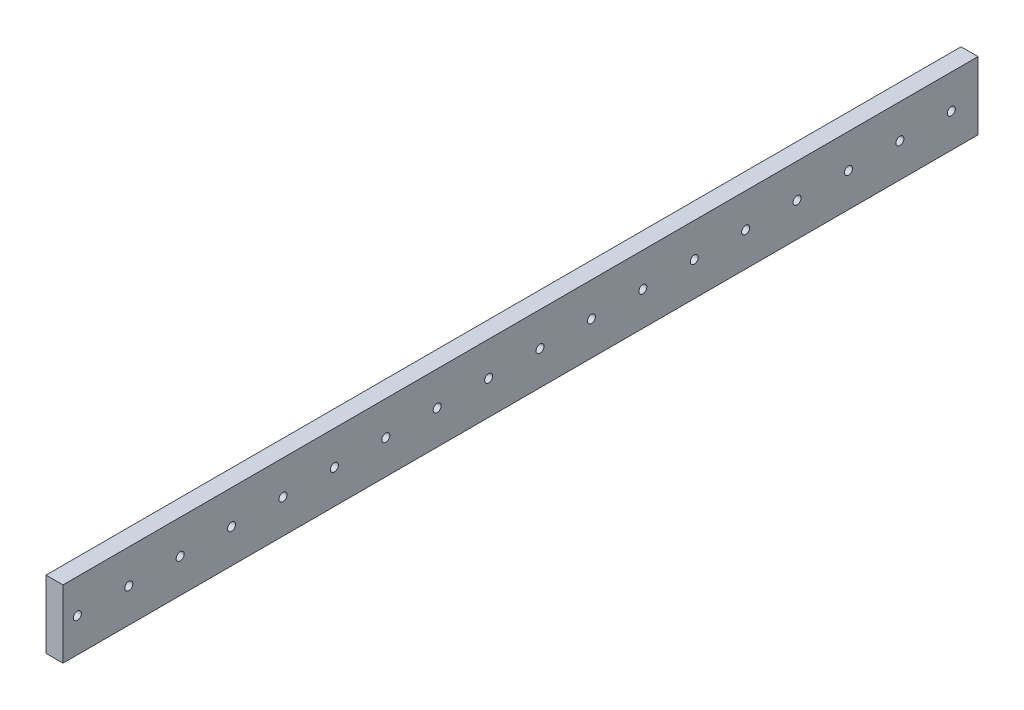
ISO-10303-21;
HEADER;
FILE_DESCRIPTION(('STEP AP214'),'2;1');
FILE_NAME('part.step','',(''),(''),'','','');
FILE_SCHEMA(('AUTOMOTIVE_DESIGN { 1 0 10303 214 1 1 1 1 }'));
ENDSEC;
DATA;
#1=APPLICATION_CONTEXT('core data for automotive mechanical design processes');
#2=APPLICATION_PROTOCOL_DEFINITION('international standard','automotive_design',2000,#1);
#3=PRODUCT_CONTEXT('',#1,'mechanical');
#4=PRODUCT('Part','Part','',(#3));
#5=PRODUCT_RELATED_PRODUCT_CATEGORY('part','',(#4));
#6=PRODUCT_DEFINITION_FORMATION('','',#4);
#7=PRODUCT_DEFINITION_CONTEXT('part definition',#1,'design');
#8=PRODUCT_DEFINITION('design','',#6,#7);
#9=PRODUCT_DEFINITION_SHAPE('','',#8);
#10=(LENGTH_UNIT() NAMED_UNIT(*) SI_UNIT(.MILLI.,.METRE.));
#11=(NAMED_UNIT(*) PLANE_ANGLE_UNIT() SI_UNIT($,.RADIAN.));
#12=(NAMED_UNIT(*) SI_UNIT($,.STERADIAN.) SOLID_ANGLE_UNIT());
#13=UNCERTAINTY_MEASURE_WITH_UNIT(LENGTH_MEASURE(1.E-05),#10,'distance_accuracy_value','');
#14=(GEOMETRIC_REPRESENTATION_CONTEXT(3) GLOBAL_UNCERTAINTY_ASSIGNED_CONTEXT((#13)) GLOBAL_UNIT_ASSIGNED_CONTEXT((#10,
#11,#12)) REPRESENTATION_CONTEXT('',''));
#15=CARTESIAN_POINT('',(0.,0.,0.));
#16=DIRECTION('',(0.,0.,1.));
#17=DIRECTION('',(1.,0.,0.));
#18=AXIS2_PLACEMENT_3D('',#15,#16,#17);
#19=CARTESIAN_POINT('',(6.35,-25.4,-685.3));
#20=DIRECTION('',(1.,0.,0.));
#21=DIRECTION('',(0.,0.,-1.));
#22=AXIS2_PLACEMENT_3D('',#19,#20,#21);
#23=PLANE('',#22);
#24=CARTESIAN_POINT('',(6.35,0.,-10.7999999999999));
#25=DIRECTION('',(-1.,0.,0.));
#26=DIRECTION('',(0.,0.,1.));
#27=AXIS2_PLACEMENT_3D('',#24,#25,#26);
#28=CIRCLE('',#27,3.00000000000005);
#29=CARTESIAN_POINT('',(6.35,0.,-7.79999999999987));
#30=VERTEX_POINT('',#29);
#31=EDGE_CURVE('E205',#30,#30,#28,.T.);
#32=ORIENTED_EDGE('',*,*,#31,.T.);
#33=EDGE_LOOP('',(#32));
#34=FACE_BOUND('',#33,.T.);
#35=CARTESIAN_POINT('',(6.35,0.,-87.7999999999999));
#36=DIRECTION('',(-1.,0.,0.));
#37=DIRECTION('',(0.,0.,1.));
#38=AXIS2_PLACEMENT_3D('',#35,#36,#37);
#39=CIRCLE('',#38,3.00000000000005);
#40=CARTESIAN_POINT('',(6.35,0.,-84.7999999999998));
#41=VERTEX_POINT('',#40);
#42=EDGE_CURVE('E213',#41,#41,#39,.T.);
#43=ORIENTED_EDGE('',*,*,#42,.T.);
#44=EDGE_LOOP('',(#43));
#45=FACE_BOUND('',#44,.T.);
#46=CARTESIAN_POINT('',(6.35,0.,-126.3));
#47=DIRECTION('',(-1.,0.,0.));
#48=DIRECTION('',(0.,0.,1.));
#49=AXIS2_PLACEMENT_3D('',#46,#47,#48);
#50=CIRCLE('',#49,3.00000000000005);
#51=CARTESIAN_POINT('',(6.35,0.,-123.3));
#52=VERTEX_POINT('',#51);
#53=EDGE_CURVE('E219',#52,#52,#50,.T.);
#54=ORIENTED_EDGE('',*,*,#53,.T.);
#55=EDGE_LOOP('',(#54));
#56=FACE_BOUND('',#55,.T.);
#57=CARTESIAN_POINT('',(6.35,0.,-164.8));
#58=DIRECTION('',(-1.,0.,0.));
#59=DIRECTION('',(0.,0.,1.));
#60=AXIS2_PLACEMENT_3D('',#57,#58,#59);
#61=CIRCLE('',#60,3.00000000000005);
#62=CARTESIAN_POINT('',(6.35,0.,-161.8));
#63=VERTEX_POINT('',#62);
#64=EDGE_CURVE('E225',#63,#63,#61,.T.);
#65=ORIENTED_EDGE('',*,*,#64,.T.);
#66=EDGE_LOOP('',(#65));
#67=FACE_BOUND('',#66,.T.);
#68=CARTESIAN_POINT('',(6.35,0.,-203.3));
#69=DIRECTION('',(-1.,0.,0.));
#70=DIRECTION('',(0.,0.,1.));
#71=AXIS2_PLACEMENT_3D('',#68,#69,#70);
#72=CIRCLE('',#71,3.00000000000005);
#73=CARTESIAN_POINT('',(6.35,0.,-200.3));
#74=VERTEX_POINT('',#73);
#75=EDGE_CURVE('E231',#74,#74,#72,.T.);
#76=ORIENTED_EDGE('',*,*,#75,.T.);
#77=EDGE_LOOP('',(#76));
#78=FACE_BOUND('',#77,.T.);
#79=CARTESIAN_POINT('',(6.35,0.,-241.8));
#80=DIRECTION('',(-1.,0.,0.));
#81=DIRECTION('',(0.,0.,1.));
#82=AXIS2_PLACEMENT_3D('',#79,#80,#81);
#83=CIRCLE('',#82,3.00000000000005);
#84=CARTESIAN_POINT('',(6.35,0.,-238.8));
#85=VERTEX_POINT('',#84);
#86=EDGE_CURVE('E237',#85,#85,#83,.T.);
#87=ORIENTED_EDGE('',*,*,#86,.T.);
#88=EDGE_LOOP('',(#87));
#89=FACE_BOUND('',#88,.T.);
#90=CARTESIAN_POINT('',(6.35,0.,-280.3));
#91=DIRECTION('',(-1.,0.,0.));
#92=DIRECTION('',(0.,0.,1.));
#93=AXIS2_PLACEMENT_3D('',#90,#91,#92);
#94=CIRCLE('',#93,3.00000000000005);
#95=CARTESIAN_POINT('',(6.35,0.,-277.3));
#96=VERTEX_POINT('',#95);
#97=EDGE_CURVE('E243',#96,#96,#94,.T.);
#98=ORIENTED_EDGE('',*,*,#97,.T.);
#99=EDGE_LOOP('',(#98));
#100=FACE_BOUND('',#99,.T.);
#101=CARTESIAN_POINT('',(6.35,0.,-318.8));
#102=DIRECTION('',(-1.,0.,0.));
#103=DIRECTION('',(0.,0.,1.));
#104=AXIS2_PLACEMENT_3D('',#101,#102,#103);
#105=CIRCLE('',#104,3.00000000000005);
#106=CARTESIAN_POINT('',(6.35,0.,-315.8));
#107=VERTEX_POINT('',#106);
#108=EDGE_CURVE('E249',#107,#107,#105,.T.);
#109=ORIENTED_EDGE('',*,*,#108,.T.);
#110=EDGE_LOOP('',(#109));
#111=FACE_BOUND('',#110,.T.);
#112=CARTESIAN_POINT('',(6.35,0.,-357.3));
#113=DIRECTION('',(-1.,0.,0.));
#114=DIRECTION('',(0.,0.,1.));
#115=AXIS2_PLACEMENT_3D('',#112,#113,#114);
#116=CIRCLE('',#115,3.00000000000005);
#117=CARTESIAN_POINT('',(6.35,0.,-354.3));
#118=VERTEX_POINT('',#117);
#119=EDGE_CURVE('E255',#118,#118,#116,.T.);
#120=ORIENTED_EDGE('',*,*,#119,.T.);
#121=EDGE_LOOP('',(#120));
#122=FACE_BOUND('',#121,.T.);
#123=CARTESIAN_POINT('',(6.35,0.,-395.8));
#124=DIRECTION('',(-1.,0.,0.));
#125=DIRECTION('',(0.,0.,1.));
#126=AXIS2_PLACEMENT_3D('',#123,#124,#125);
#127=CIRCLE('',#126,3.00000000000005);
#128=CARTESIAN_POINT('',(6.35,0.,-392.8));
#129=VERTEX_POINT('',#128);
#130=EDGE_CURVE('E261',#129,#129,#127,.T.);
#131=ORIENTED_EDGE('',*,*,#130,.T.);
#132=EDGE_LOOP('',(#131));
#133=FACE_BOUND('',#132,.T.);
#134=CARTESIAN_POINT('',(6.35,0.,-434.3));
#135=DIRECTION('',(-1.,0.,0.));
#136=DIRECTION('',(0.,0.,1.));
#137=AXIS2_PLACEMENT_3D('',#134,#135,#136);
#138=CIRCLE('',#137,3.00000000000005);
#139=CARTESIAN_POINT('',(6.35,0.,-431.3));
#140=VERTEX_POINT('',#139);
#141=EDGE_CURVE('E267',#140,#140,#138,.T.);
#142=ORIENTED_EDGE('',*,*,#141,.T.);
#143=EDGE_LOOP('',(#142));
#144=FACE_BOUND('',#143,.T.);
#145=CARTESIAN_POINT('',(6.35,0.,-472.8));
#146=DIRECTION('',(-1.,0.,0.));
#147=DIRECTION('',(0.,0.,1.));
#148=AXIS2_PLACEMENT_3D('',#145,#146,#147);
#149=CIRCLE('',#148,3.00000000000005);
#150=CARTESIAN_POINT('',(6.35,0.,-469.8));
#151=VERTEX_POINT('',#150);
#152=EDGE_CURVE('E273',#151,#151,#149,.T.);
#153=ORIENTED_EDGE('',*,*,#152,.T.);
#154=EDGE_LOOP('',(#153));
#155=FACE_BOUND('',#154,.T.);
#156=CARTESIAN_POINT('',(6.35,0.,-511.3));
#157=DIRECTION('',(-1.,0.,0.));
#158=DIRECTION('',(0.,0.,1.));
#159=AXIS2_PLACEMENT_3D('',#156,#157,#158);
#160=CIRCLE('',#159,3.00000000000005);
#161=CARTESIAN_POINT('',(6.35,0.,-508.3));
#162=VERTEX_POINT('',#161);
#163=EDGE_CURVE('E279',#162,#162,#160,.T.);
#164=ORIENTED_EDGE('',*,*,#163,.T.);
#165=EDGE_LOOP('',(#164));
#166=FACE_BOUND('',#165,.T.);
#167=CARTESIAN_POINT('',(6.35,0.,-549.8));
#168=DIRECTION('',(-1.,0.,0.));
#169=DIRECTION('',(0.,0.,1.));
#170=AXIS2_PLACEMENT_3D('',#167,#168,#169);
#171=CIRCLE('',#170,2.99999999999993);
#172=CARTESIAN_POINT('',(6.35,0.,-546.8));
#173=VERTEX_POINT('',#172);
#174=EDGE_CURVE('E285',#173,#173,#171,.T.);
#175=ORIENTED_EDGE('',*,*,#174,.T.);
#176=EDGE_LOOP('',(#175));
#177=FACE_BOUND('',#176,.T.);
#178=CARTESIAN_POINT('',(6.35,0.,-588.3));
#179=DIRECTION('',(-1.,0.,0.));
#180=DIRECTION('',(0.,0.,1.));
#181=AXIS2_PLACEMENT_3D('',#178,#179,#180);
#182=CIRCLE('',#181,3.00000000000005);
#183=CARTESIAN_POINT('',(6.35,0.,-585.3));
#184=VERTEX_POINT('',#183);
#185=EDGE_CURVE('E291',#184,#184,#182,.T.);
#186=ORIENTED_EDGE('',*,*,#185,.T.);
#187=EDGE_LOOP('',(#186));
#188=FACE_BOUND('',#187,.T.);
#189=CARTESIAN_POINT('',(6.35,0.,-626.8));
#190=DIRECTION('',(-1.,0.,0.));
#191=DIRECTION('',(0.,0.,1.));
#192=AXIS2_PLACEMENT_3D('',#189,#190,#191);
#193=CIRCLE('',#192,3.00000000000005);
#194=CARTESIAN_POINT('',(6.35,0.,-623.8));
#195=VERTEX_POINT('',#194);
#196=EDGE_CURVE('E297',#195,#195,#193,.T.);
#197=ORIENTED_EDGE('',*,*,#196,.T.);
#198=EDGE_LOOP('',(#197));
#199=FACE_BOUND('',#198,.T.);
#200=CARTESIAN_POINT('',(6.35,0.,-49.2999999999999));
#201=DIRECTION('',(-1.,0.,0.));
#202=DIRECTION('',(0.,0.,1.));
#203=AXIS2_PLACEMENT_3D('',#200,#201,#202);
#204=CIRCLE('',#203,3.00000000000005);
#205=CARTESIAN_POINT('',(6.35,0.,-46.2999999999998));
#206=VERTEX_POINT('',#205);
#207=EDGE_CURVE('E303',#206,#206,#204,.T.);
#208=ORIENTED_EDGE('',*,*,#207,.T.);
#209=EDGE_LOOP('',(#208));
#210=FACE_BOUND('',#209,.T.);
#211=CARTESIAN_POINT('',(6.35,0.,-665.3));
#212=DIRECTION('',(-1.,0.,0.));
#213=DIRECTION('',(0.,0.,1.));
#214=AXIS2_PLACEMENT_3D('',#211,#212,#213);
#215=CIRCLE('',#214,3.00000000000005);
#216=CARTESIAN_POINT('',(6.35,0.,-662.3));
#217=VERTEX_POINT('',#216);
#218=EDGE_CURVE('E102',#217,#217,#215,.T.);
#219=ORIENTED_EDGE('',*,*,#218,.T.);
#220=EDGE_LOOP('',(#219));
#221=FACE_BOUND('',#220,.T.);
#222=DIRECTION('',(0.,1.,0.));
#223=VECTOR('',#222,1.);
#224=CARTESIAN_POINT('',(6.35,-25.4,0.));
#225=LINE('',#224,#223);
#226=CARTESIAN_POINT('',(6.35,-25.4,0.));
#227=VERTEX_POINT('',#226);
#228=CARTESIAN_POINT('',(6.35,25.4,0.));
#229=VERTEX_POINT('',#228);
#230=EDGE_CURVE('E98',#227,#229,#225,.T.);
#231=ORIENTED_EDGE('',*,*,#230,.F.);
#232=DIRECTION('',(0.,0.,1.));
#233=VECTOR('',#232,1.);
#234=CARTESIAN_POINT('',(6.35,-25.4,-685.3));
#235=LINE('',#234,#233);
#236=CARTESIAN_POINT('',(6.35,-25.4,-685.3));
#237=VERTEX_POINT('',#236);
#238=EDGE_CURVE('E11',#237,#227,#235,.T.);
#239=ORIENTED_EDGE('',*,*,#238,.F.);
#240=DIRECTION('',(0.,1.,0.));
#241=VECTOR('',#240,1.);
#242=CARTESIAN_POINT('',(6.35,-25.4,-685.3));
#243=LINE('',#242,#241);
#244=CARTESIAN_POINT('',(6.35,25.4,-685.3));
#245=VERTEX_POINT('',#244);
#246=EDGE_CURVE('E91',#237,#245,#243,.T.);
#247=ORIENTED_EDGE('',*,*,#246,.T.);
#248=DIRECTION('',(0.,0.,1.));
#249=VECTOR('',#248,1.);
#250=CARTESIAN_POINT('',(6.35,25.4,-685.3));
#251=LINE('',#250,#249);
#252=EDGE_CURVE('E36',#245,#229,#251,.T.);
#253=ORIENTED_EDGE('',*,*,#252,.T.);
#254=EDGE_LOOP('',(#231,#239,#247,#253));
#255=FACE_BOUND('',#254,.T.);
#256=ADVANCED_FACE('F33',(#34,#45,#56,#67,#78,#89,#100,#111,#122,#133,#144,#155,#166,#177,#188,
#199,#210,#221,#255),#23,.T.);
#257=CARTESIAN_POINT('',(-6.35,-25.4,-685.3));
#258=DIRECTION('',(0.,-1.,0.));
#259=DIRECTION('',(0.,0.,-1.));
#260=AXIS2_PLACEMENT_3D('',#257,#258,#259);
#261=PLANE('',#260);
#262=DIRECTION('',(1.,0.,0.));
#263=VECTOR('',#262,1.);
#264=CARTESIAN_POINT('',(-6.35,-25.4,0.));
#265=LINE('',#264,#263);
#266=CARTESIAN_POINT('',(-6.35,-25.4,0.));
#267=VERTEX_POINT('',#266);
#268=EDGE_CURVE('E93',#267,#227,#265,.T.);
#269=ORIENTED_EDGE('',*,*,#268,.F.);
#270=DIRECTION('',(0.,0.,1.));
#271=VECTOR('',#270,1.);
#272=CARTESIAN_POINT('',(-6.35,-25.4,-685.3));
#273=LINE('',#272,#271);
#274=CARTESIAN_POINT('',(-6.35,-25.4,-685.3));
#275=VERTEX_POINT('',#274);
#276=EDGE_CURVE('E42',#275,#267,#273,.T.);
#277=ORIENTED_EDGE('',*,*,#276,.F.);
#278=DIRECTION('',(1.,0.,0.));
#279=VECTOR('',#278,1.);
#280=CARTESIAN_POINT('',(-6.35,-25.4,-685.3));
#281=LINE('',#280,#279);
#282=EDGE_CURVE('E88',#275,#237,#281,.T.);
#283=ORIENTED_EDGE('',*,*,#282,.T.);
#284=ORIENTED_EDGE('',*,*,#238,.T.);
#285=EDGE_LOOP('',(#269,#277,#283,#284));
#286=FACE_BOUND('',#285,.T.);
#287=ADVANCED_FACE('F109',(#286),#261,.T.);
#288=CARTESIAN_POINT('',(-6.35,-25.4,-685.3));
#289=DIRECTION('',(-1.,0.,0.));
#290=DIRECTION('',(0.,0.,1.));
#291=AXIS2_PLACEMENT_3D('',#288,#289,#290);
#292=PLANE('',#291);
#293=CARTESIAN_POINT('',(-6.35,0.,-10.7999999999999));
#294=DIRECTION('',(-1.,0.,0.));
#295=DIRECTION('',(0.,0.,1.));
#296=AXIS2_PLACEMENT_3D('',#293,#294,#295);
#297=CIRCLE('',#296,3.00000000000005);
#298=CARTESIAN_POINT('',(-6.35,0.,-7.79999999999987));
#299=VERTEX_POINT('',#298);
#300=EDGE_CURVE('E208',#299,#299,#297,.T.);
#301=ORIENTED_EDGE('',*,*,#300,.F.);
#302=EDGE_LOOP('',(#301));
#303=FACE_BOUND('',#302,.T.);
#304=CARTESIAN_POINT('',(-6.35,0.,-87.7999999999999));
#305=DIRECTION('',(-1.,0.,0.));
#306=DIRECTION('',(0.,0.,1.));
#307=AXIS2_PLACEMENT_3D('',#304,#305,#306);
#308=CIRCLE('',#307,3.00000000000005);
#309=CARTESIAN_POINT('',(-6.35,0.,-84.7999999999998));
#310=VERTEX_POINT('',#309);
#311=EDGE_CURVE('E210',#310,#310,#308,.T.);
#312=ORIENTED_EDGE('',*,*,#311,.F.);
#313=EDGE_LOOP('',(#312));
#314=FACE_BOUND('',#313,.T.);
#315=CARTESIAN_POINT('',(-6.35,0.,-126.3));
#316=DIRECTION('',(-1.,0.,0.));
#317=DIRECTION('',(0.,0.,1.));
#318=AXIS2_PLACEMENT_3D('',#315,#316,#317);
#319=CIRCLE('',#318,3.00000000000005);
#320=CARTESIAN_POINT('',(-6.35,0.,-123.3));
#321=VERTEX_POINT('',#320);
#322=EDGE_CURVE('E216',#321,#321,#319,.T.);
#323=ORIENTED_EDGE('',*,*,#322,.F.);
#324=EDGE_LOOP('',(#323));
#325=FACE_BOUND('',#324,.T.);
#326=CARTESIAN_POINT('',(-6.35,0.,-164.8));
#327=DIRECTION('',(-1.,0.,0.));
#328=DIRECTION('',(0.,0.,1.));
#329=AXIS2_PLACEMENT_3D('',#326,#327,#328);
#330=CIRCLE('',#329,3.00000000000005);
#331=CARTESIAN_POINT('',(-6.35,0.,-161.8));
#332=VERTEX_POINT('',#331);
#333=EDGE_CURVE('E222',#332,#332,#330,.T.);
#334=ORIENTED_EDGE('',*,*,#333,.F.);
#335=EDGE_LOOP('',(#334));
#336=FACE_BOUND('',#335,.T.);
#337=CARTESIAN_POINT('',(-6.35,0.,-203.3));
#338=DIRECTION('',(-1.,0.,0.));
#339=DIRECTION('',(0.,0.,1.));
#340=AXIS2_PLACEMENT_3D('',#337,#338,#339);
#341=CIRCLE('',#340,3.00000000000005);
#342=CARTESIAN_POINT('',(-6.35,0.,-200.3));
#343=VERTEX_POINT('',#342);
#344=EDGE_CURVE('E228',#343,#343,#341,.T.);
#345=ORIENTED_EDGE('',*,*,#344,.F.);
#346=EDGE_LOOP('',(#345));
#347=FACE_BOUND('',#346,.T.);
#348=CARTESIAN_POINT('',(-6.35,0.,-241.8));
#349=DIRECTION('',(-1.,0.,0.));
#350=DIRECTION('',(0.,0.,1.));
#351=AXIS2_PLACEMENT_3D('',#348,#349,#350);
#352=CIRCLE('',#351,3.00000000000005);
#353=CARTESIAN_POINT('',(-6.35,0.,-238.8));
#354=VERTEX_POINT('',#353);
#355=EDGE_CURVE('E234',#354,#354,#352,.T.);
#356=ORIENTED_EDGE('',*,*,#355,.F.);
#357=EDGE_LOOP('',(#356));
#358=FACE_BOUND('',#357,.T.);
#359=CARTESIAN_POINT('',(-6.35,0.,-280.3));
#360=DIRECTION('',(-1.,0.,0.));
#361=DIRECTION('',(0.,0.,1.));
#362=AXIS2_PLACEMENT_3D('',#359,#360,#361);
#363=CIRCLE('',#362,3.00000000000005);
#364=CARTESIAN_POINT('',(-6.35,0.,-277.3));
#365=VERTEX_POINT('',#364);
#366=EDGE_CURVE('E240',#365,#365,#363,.T.);
#367=ORIENTED_EDGE('',*,*,#366,.F.);
#368=EDGE_LOOP('',(#367));
#369=FACE_BOUND('',#368,.T.);
#370=CARTESIAN_POINT('',(-6.35,0.,-318.8));
#371=DIRECTION('',(-1.,0.,0.));
#372=DIRECTION('',(0.,0.,1.));
#373=AXIS2_PLACEMENT_3D('',#370,#371,#372);
#374=CIRCLE('',#373,3.00000000000005);
#375=CARTESIAN_POINT('',(-6.35,0.,-315.8));
#376=VERTEX_POINT('',#375);
#377=EDGE_CURVE('E246',#376,#376,#374,.T.);
#378=ORIENTED_EDGE('',*,*,#377,.F.);
#379=EDGE_LOOP('',(#378));
#380=FACE_BOUND('',#379,.T.);
#381=CARTESIAN_POINT('',(-6.35,0.,-357.3));
#382=DIRECTION('',(-1.,0.,0.));
#383=DIRECTION('',(0.,0.,1.));
#384=AXIS2_PLACEMENT_3D('',#381,#382,#383);
#385=CIRCLE('',#384,3.00000000000005);
#386=CARTESIAN_POINT('',(-6.35,0.,-354.3));
#387=VERTEX_POINT('',#386);
#388=EDGE_CURVE('E252',#387,#387,#385,.T.);
#389=ORIENTED_EDGE('',*,*,#388,.F.);
#390=EDGE_LOOP('',(#389));
#391=FACE_BOUND('',#390,.T.);
#392=CARTESIAN_POINT('',(-6.35,0.,-395.8));
#393=DIRECTION('',(-1.,0.,0.));
#394=DIRECTION('',(0.,0.,1.));
#395=AXIS2_PLACEMENT_3D('',#392,#393,#394);
#396=CIRCLE('',#395,3.00000000000005);
#397=CARTESIAN_POINT('',(-6.35,0.,-392.8));
#398=VERTEX_POINT('',#397);
#399=EDGE_CURVE('E258',#398,#398,#396,.T.);
#400=ORIENTED_EDGE('',*,*,#399,.F.);
#401=EDGE_LOOP('',(#400));
#402=FACE_BOUND('',#401,.T.);
#403=CARTESIAN_POINT('',(-6.35,0.,-434.3));
#404=DIRECTION('',(-1.,0.,0.));
#405=DIRECTION('',(0.,0.,1.));
#406=AXIS2_PLACEMENT_3D('',#403,#404,#405);
#407=CIRCLE('',#406,3.00000000000005);
#408=CARTESIAN_POINT('',(-6.35,0.,-431.3));
#409=VERTEX_POINT('',#408);
#410=EDGE_CURVE('E264',#409,#409,#407,.T.);
#411=ORIENTED_EDGE('',*,*,#410,.F.);
#412=EDGE_LOOP('',(#411));
#413=FACE_BOUND('',#412,.T.);
#414=CARTESIAN_POINT('',(-6.35,0.,-472.8));
#415=DIRECTION('',(-1.,0.,0.));
#416=DIRECTION('',(0.,0.,1.));
#417=AXIS2_PLACEMENT_3D('',#414,#415,#416);
#418=CIRCLE('',#417,3.00000000000005);
#419=CARTESIAN_POINT('',(-6.35,0.,-469.8));
#420=VERTEX_POINT('',#419);
#421=EDGE_CURVE('E270',#420,#420,#418,.T.);
#422=ORIENTED_EDGE('',*,*,#421,.F.);
#423=EDGE_LOOP('',(#422));
#424=FACE_BOUND('',#423,.T.);
#425=CARTESIAN_POINT('',(-6.35,0.,-511.3));
#426=DIRECTION('',(-1.,0.,0.));
#427=DIRECTION('',(0.,0.,1.));
#428=AXIS2_PLACEMENT_3D('',#425,#426,#427);
#429=CIRCLE('',#428,3.00000000000005);
#430=CARTESIAN_POINT('',(-6.35,0.,-508.3));
#431=VERTEX_POINT('',#430);
#432=EDGE_CURVE('E276',#431,#431,#429,.T.);
#433=ORIENTED_EDGE('',*,*,#432,.F.);
#434=EDGE_LOOP('',(#433));
#435=FACE_BOUND('',#434,.T.);
#436=CARTESIAN_POINT('',(-6.35,0.,-549.8));
#437=DIRECTION('',(-1.,0.,0.));
#438=DIRECTION('',(0.,0.,1.));
#439=AXIS2_PLACEMENT_3D('',#436,#437,#438);
#440=CIRCLE('',#439,2.99999999999993);
#441=CARTESIAN_POINT('',(-6.35,0.,-546.8));
#442=VERTEX_POINT('',#441);
#443=EDGE_CURVE('E282',#442,#442,#440,.T.);
#444=ORIENTED_EDGE('',*,*,#443,.F.);
#445=EDGE_LOOP('',(#444));
#446=FACE_BOUND('',#445,.T.);
#447=CARTESIAN_POINT('',(-6.35,0.,-588.3));
#448=DIRECTION('',(-1.,0.,0.));
#449=DIRECTION('',(0.,0.,1.));
#450=AXIS2_PLACEMENT_3D('',#447,#448,#449);
#451=CIRCLE('',#450,3.00000000000005);
#452=CARTESIAN_POINT('',(-6.35,0.,-585.3));
#453=VERTEX_POINT('',#452);
#454=EDGE_CURVE('E288',#453,#453,#451,.T.);
#455=ORIENTED_EDGE('',*,*,#454,.F.);
#456=EDGE_LOOP('',(#455));
#457=FACE_BOUND('',#456,.T.);
#458=CARTESIAN_POINT('',(-6.35,0.,-626.8));
#459=DIRECTION('',(-1.,0.,0.));
#460=DIRECTION('',(0.,0.,1.));
#461=AXIS2_PLACEMENT_3D('',#458,#459,#460);
#462=CIRCLE('',#461,3.00000000000005);
#463=CARTESIAN_POINT('',(-6.35,0.,-623.8));
#464=VERTEX_POINT('',#463);
#465=EDGE_CURVE('E294',#464,#464,#462,.T.);
#466=ORIENTED_EDGE('',*,*,#465,.F.);
#467=EDGE_LOOP('',(#466));
#468=FACE_BOUND('',#467,.T.);
#469=CARTESIAN_POINT('',(-6.35,0.,-49.2999999999999));
#470=DIRECTION('',(-1.,0.,0.));
#471=DIRECTION('',(0.,0.,1.));
#472=AXIS2_PLACEMENT_3D('',#469,#470,#471);
#473=CIRCLE('',#472,3.00000000000005);
#474=CARTESIAN_POINT('',(-6.35,0.,-46.2999999999998));
#475=VERTEX_POINT('',#474);
#476=EDGE_CURVE('E300',#475,#475,#473,.T.);
#477=ORIENTED_EDGE('',*,*,#476,.F.);
#478=EDGE_LOOP('',(#477));
#479=FACE_BOUND('',#478,.T.);
#480=CARTESIAN_POINT('',(-6.35,0.,-665.3));
#481=DIRECTION('',(-1.,0.,0.));
#482=DIRECTION('',(0.,0.,1.));
#483=AXIS2_PLACEMENT_3D('',#480,#481,#482);
#484=CIRCLE('',#483,3.00000000000005);
#485=CARTESIAN_POINT('',(-6.35,0.,-662.3));
#486=VERTEX_POINT('',#485);
#487=EDGE_CURVE('E306',#486,#486,#484,.T.);
#488=ORIENTED_EDGE('',*,*,#487,.F.);
#489=EDGE_LOOP('',(#488));
#490=FACE_BOUND('',#489,.T.);
#491=DIRECTION('',(0.,-1.,0.));
#492=VECTOR('',#491,1.);
#493=CARTESIAN_POINT('',(-6.35,-25.4,0.));
#494=LINE('',#493,#492);
#495=CARTESIAN_POINT('',(-6.35,25.4,0.));
#496=VERTEX_POINT('',#495);
#497=EDGE_CURVE('E83',#496,#267,#494,.T.);
#498=ORIENTED_EDGE('',*,*,#497,.F.);
#499=DIRECTION('',(0.,0.,1.));
#500=VECTOR('',#499,1.);
#501=CARTESIAN_POINT('',(-6.35,25.4,-685.3));
#502=LINE('',#501,#500);
#503=CARTESIAN_POINT('',(-6.35,25.4,-685.3));
#504=VERTEX_POINT('',#503);
#505=EDGE_CURVE('E78',#504,#496,#502,.T.);
#506=ORIENTED_EDGE('',*,*,#505,.F.);
#507=DIRECTION('',(0.,-1.,0.));
#508=VECTOR('',#507,1.);
#509=CARTESIAN_POINT('',(-6.35,-25.4,-685.3));
#510=LINE('',#509,#508);
#511=EDGE_CURVE('E81',#504,#275,#510,.T.);
#512=ORIENTED_EDGE('',*,*,#511,.T.);
#513=ORIENTED_EDGE('',*,*,#276,.T.);
#514=EDGE_LOOP('',(#498,#506,#512,#513));
#515=FACE_BOUND('',#514,.T.);
#516=ADVANCED_FACE('F80',(#303,#314,#325,#336,#347,#358,#369,#380,#391,#402,#413,#424,#435,#446,
#457,#468,#479,#490,#515),#292,.T.);
#517=CARTESIAN_POINT('',(-6.35,25.4,-685.3));
#518=DIRECTION('',(0.,1.,0.));
#519=DIRECTION('',(0.,0.,1.));
#520=AXIS2_PLACEMENT_3D('',#517,#518,#519);
#521=PLANE('',#520);
#522=DIRECTION('',(-1.,0.,0.));
#523=VECTOR('',#522,1.);
#524=CARTESIAN_POINT('',(-6.35,25.4,0.));
#525=LINE('',#524,#523);
#526=EDGE_CURVE('E101',#229,#496,#525,.T.);
#527=ORIENTED_EDGE('',*,*,#526,.F.);
#528=ORIENTED_EDGE('',*,*,#252,.F.);
#529=DIRECTION('',(-1.,0.,0.));
#530=VECTOR('',#529,1.);
#531=CARTESIAN_POINT('',(-6.35,25.4,-685.3));
#532=LINE('',#531,#530);
#533=EDGE_CURVE('E87',#245,#504,#532,.T.);
#534=ORIENTED_EDGE('',*,*,#533,.T.);
#535=ORIENTED_EDGE('',*,*,#505,.T.);
#536=EDGE_LOOP('',(#527,#528,#534,#535));
#537=FACE_BOUND('',#536,.T.);
#538=ADVANCED_FACE('F90',(#537),#521,.T.);
#539=CARTESIAN_POINT('',(0.,0.,-685.3));
#540=DIRECTION('',(0.,0.,-1.));
#541=DIRECTION('',(-1.,0.,0.));
#542=AXIS2_PLACEMENT_3D('',#539,#540,#541);
#543=PLANE('',#542);
#544=ORIENTED_EDGE('',*,*,#246,.F.);
#545=ORIENTED_EDGE('',*,*,#282,.F.);
#546=ORIENTED_EDGE('',*,*,#511,.F.);
#547=ORIENTED_EDGE('',*,*,#533,.F.);
#548=EDGE_LOOP('',(#544,#545,#546,#547));
#549=FACE_BOUND('',#548,.T.);
#550=ADVANCED_FACE('F86',(#549),#543,.T.);
#551=CARTESIAN_POINT('',(0.,0.,0.));
#552=DIRECTION('',(0.,0.,-1.));
#553=DIRECTION('',(-1.,0.,0.));
#554=AXIS2_PLACEMENT_3D('',#551,#552,#553);
#555=PLANE('',#554);
#556=ORIENTED_EDGE('',*,*,#230,.T.);
#557=ORIENTED_EDGE('',*,*,#526,.T.);
#558=ORIENTED_EDGE('',*,*,#497,.T.);
#559=ORIENTED_EDGE('',*,*,#268,.T.);
#560=EDGE_LOOP('',(#556,#557,#558,#559));
#561=FACE_BOUND('',#560,.T.);
#562=ADVANCED_FACE('F108',(#561),#555,.F.);
#563=CARTESIAN_POINT('',(6.35,0.,-665.3));
#564=DIRECTION('',(-1.,0.,0.));
#565=DIRECTION('',(0.,0.,1.));
#566=AXIS2_PLACEMENT_3D('',#563,#564,#565);
#567=CYLINDRICAL_SURFACE('',#566,3.00000000000005);
#568=ORIENTED_EDGE('',*,*,#218,.F.);
#569=EDGE_LOOP('',(#568));
#570=FACE_BOUND('',#569,.T.);
#571=ORIENTED_EDGE('',*,*,#487,.T.);
#572=EDGE_LOOP('',(#571));
#573=FACE_BOUND('',#572,.T.);
#574=ADVANCED_FACE('F128',(#570,#573),#567,.F.);
#575=CARTESIAN_POINT('',(6.35,0.,-49.2999999999999));
#576=DIRECTION('',(-1.,0.,0.));
#577=DIRECTION('',(0.,0.,1.));
#578=AXIS2_PLACEMENT_3D('',#575,#576,#577);
#579=CYLINDRICAL_SURFACE('',#578,3.00000000000005);
#580=ORIENTED_EDGE('',*,*,#207,.F.);
#581=EDGE_LOOP('',(#580));
#582=FACE_BOUND('',#581,.T.);
#583=ORIENTED_EDGE('',*,*,#476,.T.);
#584=EDGE_LOOP('',(#583));
#585=FACE_BOUND('',#584,.T.);
#586=ADVANCED_FACE('F132',(#582,#585),#579,.F.);
#587=CARTESIAN_POINT('',(6.35,0.,-626.8));
#588=DIRECTION('',(-1.,0.,0.));
#589=DIRECTION('',(0.,0.,1.));
#590=AXIS2_PLACEMENT_3D('',#587,#588,#589);
#591=CYLINDRICAL_SURFACE('',#590,3.00000000000005);
#592=ORIENTED_EDGE('',*,*,#196,.F.);
#593=EDGE_LOOP('',(#592));
#594=FACE_BOUND('',#593,.T.);
#595=ORIENTED_EDGE('',*,*,#465,.T.);
#596=EDGE_LOOP('',(#595));
#597=FACE_BOUND('',#596,.T.);
#598=ADVANCED_FACE('F136',(#594,#597),#591,.F.);
#599=CARTESIAN_POINT('',(6.35,0.,-588.3));
#600=DIRECTION('',(-1.,0.,0.));
#601=DIRECTION('',(0.,0.,1.));
#602=AXIS2_PLACEMENT_3D('',#599,#600,#601);
#603=CYLINDRICAL_SURFACE('',#602,3.00000000000005);
#604=ORIENTED_EDGE('',*,*,#185,.F.);
#605=EDGE_LOOP('',(#604));
#606=FACE_BOUND('',#605,.T.);
#607=ORIENTED_EDGE('',*,*,#454,.T.);
#608=EDGE_LOOP('',(#607));
#609=FACE_BOUND('',#608,.T.);
#610=ADVANCED_FACE('F140',(#606,#609),#603,.F.);
#611=CARTESIAN_POINT('',(6.35,0.,-549.8));
#612=DIRECTION('',(-1.,0.,0.));
#613=DIRECTION('',(0.,0.,1.));
#614=AXIS2_PLACEMENT_3D('',#611,#612,#613);
#615=CYLINDRICAL_SURFACE('',#614,2.99999999999993);
#616=ORIENTED_EDGE('',*,*,#174,.F.);
#617=EDGE_LOOP('',(#616));
#618=FACE_BOUND('',#617,.T.);
#619=ORIENTED_EDGE('',*,*,#443,.T.);
#620=EDGE_LOOP('',(#619));
#621=FACE_BOUND('',#620,.T.);
#622=ADVANCED_FACE('F144',(#618,#621),#615,.F.);
#623=CARTESIAN_POINT('',(6.35,0.,-511.3));
#624=DIRECTION('',(-1.,0.,0.));
#625=DIRECTION('',(0.,0.,1.));
#626=AXIS2_PLACEMENT_3D('',#623,#624,#625);
#627=CYLINDRICAL_SURFACE('',#626,3.00000000000005);
#628=ORIENTED_EDGE('',*,*,#163,.F.);
#629=EDGE_LOOP('',(#628));
#630=FACE_BOUND('',#629,.T.);
#631=ORIENTED_EDGE('',*,*,#432,.T.);
#632=EDGE_LOOP('',(#631));
#633=FACE_BOUND('',#632,.T.);
#634=ADVANCED_FACE('F148',(#630,#633),#627,.F.);
#635=CARTESIAN_POINT('',(6.35,0.,-472.8));
#636=DIRECTION('',(-1.,0.,0.));
#637=DIRECTION('',(0.,0.,1.));
#638=AXIS2_PLACEMENT_3D('',#635,#636,#637);
#639=CYLINDRICAL_SURFACE('',#638,3.00000000000005);
#640=ORIENTED_EDGE('',*,*,#152,.F.);
#641=EDGE_LOOP('',(#640));
#642=FACE_BOUND('',#641,.T.);
#643=ORIENTED_EDGE('',*,*,#421,.T.);
#644=EDGE_LOOP('',(#643));
#645=FACE_BOUND('',#644,.T.);
#646=ADVANCED_FACE('F152',(#642,#645),#639,.F.);
#647=CARTESIAN_POINT('',(6.35,0.,-434.3));
#648=DIRECTION('',(-1.,0.,0.));
#649=DIRECTION('',(0.,0.,1.));
#650=AXIS2_PLACEMENT_3D('',#647,#648,#649);
#651=CYLINDRICAL_SURFACE('',#650,3.00000000000005);
#652=ORIENTED_EDGE('',*,*,#141,.F.);
#653=EDGE_LOOP('',(#652));
#654=FACE_BOUND('',#653,.T.);
#655=ORIENTED_EDGE('',*,*,#410,.T.);
#656=EDGE_LOOP('',(#655));
#657=FACE_BOUND('',#656,.T.);
#658=ADVANCED_FACE('F156',(#654,#657),#651,.F.);
#659=CARTESIAN_POINT('',(6.35,0.,-395.8));
#660=DIRECTION('',(-1.,0.,0.));
#661=DIRECTION('',(0.,0.,1.));
#662=AXIS2_PLACEMENT_3D('',#659,#660,#661);
#663=CYLINDRICAL_SURFACE('',#662,3.00000000000005);
#664=ORIENTED_EDGE('',*,*,#130,.F.);
#665=EDGE_LOOP('',(#664));
#666=FACE_BOUND('',#665,.T.);
#667=ORIENTED_EDGE('',*,*,#399,.T.);
#668=EDGE_LOOP('',(#667));
#669=FACE_BOUND('',#668,.T.);
#670=ADVANCED_FACE('F160',(#666,#669),#663,.F.);
#671=CARTESIAN_POINT('',(6.35,0.,-357.3));
#672=DIRECTION('',(-1.,0.,0.));
#673=DIRECTION('',(0.,0.,1.));
#674=AXIS2_PLACEMENT_3D('',#671,#672,#673);
#675=CYLINDRICAL_SURFACE('',#674,3.00000000000005);
#676=ORIENTED_EDGE('',*,*,#119,.F.);
#677=EDGE_LOOP('',(#676));
#678=FACE_BOUND('',#677,.T.);
#679=ORIENTED_EDGE('',*,*,#388,.T.);
#680=EDGE_LOOP('',(#679));
#681=FACE_BOUND('',#680,.T.);
#682=ADVANCED_FACE('F164',(#678,#681),#675,.F.);
#683=CARTESIAN_POINT('',(6.35,0.,-318.8));
#684=DIRECTION('',(-1.,0.,0.));
#685=DIRECTION('',(0.,0.,1.));
#686=AXIS2_PLACEMENT_3D('',#683,#684,#685);
#687=CYLINDRICAL_SURFACE('',#686,3.00000000000005);
#688=ORIENTED_EDGE('',*,*,#108,.F.);
#689=EDGE_LOOP('',(#688));
#690=FACE_BOUND('',#689,.T.);
#691=ORIENTED_EDGE('',*,*,#377,.T.);
#692=EDGE_LOOP('',(#691));
#693=FACE_BOUND('',#692,.T.);
#694=ADVANCED_FACE('F168',(#690,#693),#687,.F.);
#695=CARTESIAN_POINT('',(6.35,0.,-280.3));
#696=DIRECTION('',(-1.,0.,0.));
#697=DIRECTION('',(0.,0.,1.));
#698=AXIS2_PLACEMENT_3D('',#695,#696,#697);
#699=CYLINDRICAL_SURFACE('',#698,3.00000000000005);
#700=ORIENTED_EDGE('',*,*,#97,.F.);
#701=EDGE_LOOP('',(#700));
#702=FACE_BOUND('',#701,.T.);
#703=ORIENTED_EDGE('',*,*,#366,.T.);
#704=EDGE_LOOP('',(#703));
#705=FACE_BOUND('',#704,.T.);
#706=ADVANCED_FACE('F172',(#702,#705),#699,.F.);
#707=CARTESIAN_POINT('',(6.35,0.,-241.8));
#708=DIRECTION('',(-1.,0.,0.));
#709=DIRECTION('',(0.,0.,1.));
#710=AXIS2_PLACEMENT_3D('',#707,#708,#709);
#711=CYLINDRICAL_SURFACE('',#710,3.00000000000005);
#712=ORIENTED_EDGE('',*,*,#86,.F.);
#713=EDGE_LOOP('',(#712));
#714=FACE_BOUND('',#713,.T.);
#715=ORIENTED_EDGE('',*,*,#355,.T.);
#716=EDGE_LOOP('',(#715));
#717=FACE_BOUND('',#716,.T.);
#718=ADVANCED_FACE('F176',(#714,#717),#711,.F.);
#719=CARTESIAN_POINT('',(6.35,0.,-203.3));
#720=DIRECTION('',(-1.,0.,0.));
#721=DIRECTION('',(0.,0.,1.));
#722=AXIS2_PLACEMENT_3D('',#719,#720,#721);
#723=CYLINDRICAL_SURFACE('',#722,3.00000000000005);
#724=ORIENTED_EDGE('',*,*,#75,.F.);
#725=EDGE_LOOP('',(#724));
#726=FACE_BOUND('',#725,.T.);
#727=ORIENTED_EDGE('',*,*,#344,.T.);
#728=EDGE_LOOP('',(#727));
#729=FACE_BOUND('',#728,.T.);
#730=ADVANCED_FACE('F180',(#726,#729),#723,.F.);
#731=CARTESIAN_POINT('',(6.35,0.,-164.8));
#732=DIRECTION('',(-1.,0.,0.));
#733=DIRECTION('',(0.,0.,1.));
#734=AXIS2_PLACEMENT_3D('',#731,#732,#733);
#735=CYLINDRICAL_SURFACE('',#734,3.00000000000005);
#736=ORIENTED_EDGE('',*,*,#64,.F.);
#737=EDGE_LOOP('',(#736));
#738=FACE_BOUND('',#737,.T.);
#739=ORIENTED_EDGE('',*,*,#333,.T.);
#740=EDGE_LOOP('',(#739));
#741=FACE_BOUND('',#740,.T.);
#742=ADVANCED_FACE('F184',(#738,#741),#735,.F.);
#743=CARTESIAN_POINT('',(6.35,0.,-126.3));
#744=DIRECTION('',(-1.,0.,0.));
#745=DIRECTION('',(0.,0.,1.));
#746=AXIS2_PLACEMENT_3D('',#743,#744,#745);
#747=CYLINDRICAL_SURFACE('',#746,3.00000000000005);
#748=ORIENTED_EDGE('',*,*,#53,.F.);
#749=EDGE_LOOP('',(#748));
#750=FACE_BOUND('',#749,.T.);
#751=ORIENTED_EDGE('',*,*,#322,.T.);
#752=EDGE_LOOP('',(#751));
#753=FACE_BOUND('',#752,.T.);
#754=ADVANCED_FACE('F188',(#750,#753),#747,.F.);
#755=CARTESIAN_POINT('',(6.35,0.,-87.7999999999999));
#756=DIRECTION('',(-1.,0.,0.));
#757=DIRECTION('',(0.,0.,1.));
#758=AXIS2_PLACEMENT_3D('',#755,#756,#757);
#759=CYLINDRICAL_SURFACE('',#758,3.00000000000005);
#760=ORIENTED_EDGE('',*,*,#42,.F.);
#761=EDGE_LOOP('',(#760));
#762=FACE_BOUND('',#761,.T.);
#763=ORIENTED_EDGE('',*,*,#311,.T.);
#764=EDGE_LOOP('',(#763));
#765=FACE_BOUND('',#764,.T.);
#766=ADVANCED_FACE('F192',(#762,#765),#759,.F.);
#767=CARTESIAN_POINT('',(6.35,0.,-10.7999999999999));
#768=DIRECTION('',(-1.,0.,0.));
#769=DIRECTION('',(0.,0.,1.));
#770=AXIS2_PLACEMENT_3D('',#767,#768,#769);
#771=CYLINDRICAL_SURFACE('',#770,3.00000000000005);
#772=ORIENTED_EDGE('',*,*,#31,.F.);
#773=EDGE_LOOP('',(#772));
#774=FACE_BOUND('',#773,.T.);
#775=ORIENTED_EDGE('',*,*,#300,.T.);
#776=EDGE_LOOP('',(#775));
#777=FACE_BOUND('',#776,.T.);
#778=ADVANCED_FACE('F196',(#774,#777),#771,.F.);
#779=CLOSED_SHELL('',(#256,#287,#516,#538,#550,#562,#574,#586,#598,#610,#622,#634,#646,#658,
#670,#682,#694,#706,#718,#730,#742,#754,#766,#778));
#780=MANIFOLD_SOLID_BREP('B2',#779);
#781=ADVANCED_BREP_SHAPE_REPRESENTATION('',(#18,#780),#14);
#782=SHAPE_DEFINITION_REPRESENTATION(#9,#781);
ENDSEC;
END-ISO-10303-21;
